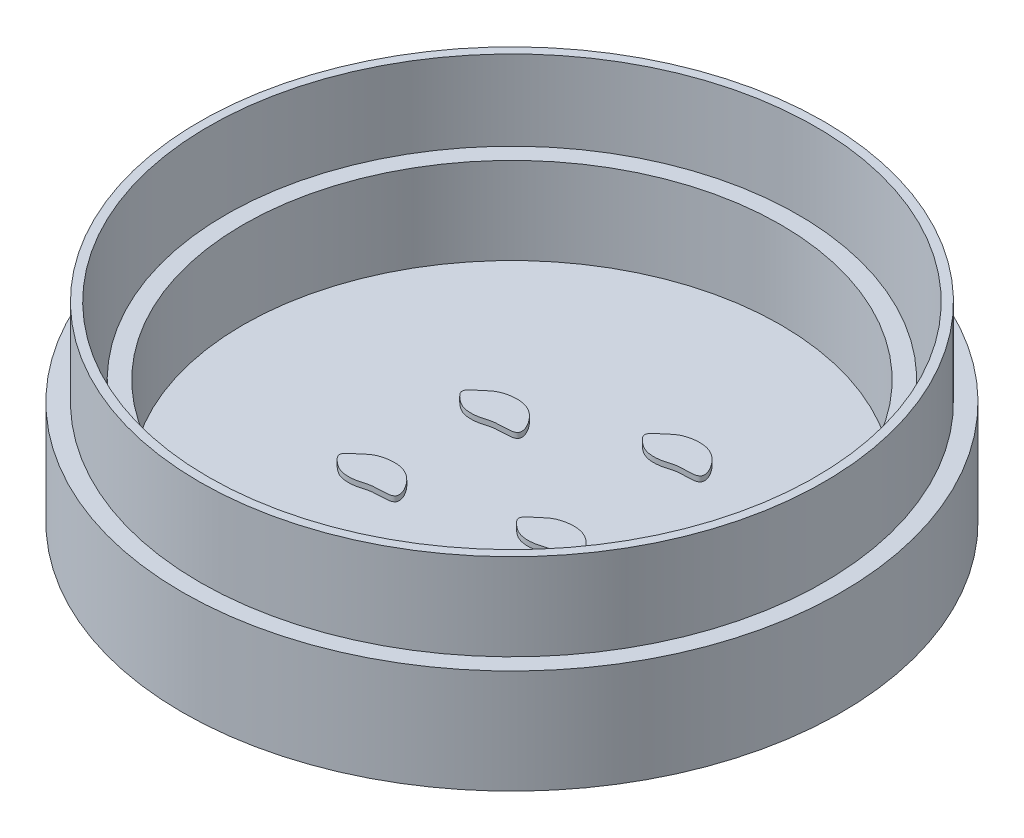
ISO-10303-21;
HEADER;
FILE_DESCRIPTION(('STEP AP214'),'2;1');
FILE_NAME('part.step','',(''),(''),'','','');
FILE_SCHEMA(('AUTOMOTIVE_DESIGN { 1 0 10303 214 1 1 1 1 }'));
ENDSEC;
DATA;
#1=APPLICATION_CONTEXT('core data for automotive mechanical design processes');
#2=APPLICATION_PROTOCOL_DEFINITION('international standard','automotive_design',2000,#1);
#3=PRODUCT_CONTEXT('',#1,'mechanical');
#4=PRODUCT('Part','Part','',(#3));
#5=PRODUCT_RELATED_PRODUCT_CATEGORY('part','',(#4));
#6=PRODUCT_DEFINITION_FORMATION('','',#4);
#7=PRODUCT_DEFINITION_CONTEXT('part definition',#1,'design');
#8=PRODUCT_DEFINITION('design','',#6,#7);
#9=PRODUCT_DEFINITION_SHAPE('','',#8);
#10=(LENGTH_UNIT() NAMED_UNIT(*) SI_UNIT(.MILLI.,.METRE.));
#11=(NAMED_UNIT(*) PLANE_ANGLE_UNIT() SI_UNIT($,.RADIAN.));
#12=(NAMED_UNIT(*) SI_UNIT($,.STERADIAN.) SOLID_ANGLE_UNIT());
#13=UNCERTAINTY_MEASURE_WITH_UNIT(LENGTH_MEASURE(1.E-05),#10,'distance_accuracy_value','');
#14=(GEOMETRIC_REPRESENTATION_CONTEXT(3) GLOBAL_UNCERTAINTY_ASSIGNED_CONTEXT((#13)) GLOBAL_UNIT_ASSIGNED_CONTEXT((#10,
#11,#12)) REPRESENTATION_CONTEXT('',''));
#15=CARTESIAN_POINT('',(0.,0.,0.));
#16=DIRECTION('',(0.,0.,1.));
#17=DIRECTION('',(1.,0.,0.));
#18=AXIS2_PLACEMENT_3D('',#15,#16,#17);
#19=CARTESIAN_POINT('',(0.,2.,0.));
#20=DIRECTION('',(0.,-1.,0.));
#21=DIRECTION('',(0.,0.,-1.));
#22=AXIS2_PLACEMENT_3D('',#19,#20,#21);
#23=CYLINDRICAL_SURFACE('',#22,17.25);
#24=CARTESIAN_POINT('',(0.,2.,0.));
#25=DIRECTION('',(0.,1.,0.));
#26=DIRECTION('',(0.,0.,1.));
#27=AXIS2_PLACEMENT_3D('',#24,#25,#26);
#28=CIRCLE('',#27,17.25);
#29=CARTESIAN_POINT('',(0.,2.,17.25));
#30=VERTEX_POINT('',#29);
#31=EDGE_CURVE('E11',#30,#30,#28,.T.);
#32=ORIENTED_EDGE('',*,*,#31,.F.);
#33=EDGE_LOOP('',(#32));
#34=FACE_BOUND('',#33,.T.);
#35=CARTESIAN_POINT('',(0.,1.,0.));
#36=DIRECTION('',(0.,1.,0.));
#37=DIRECTION('',(0.,0.,1.));
#38=AXIS2_PLACEMENT_3D('',#35,#36,#37);
#39=CIRCLE('',#38,17.25);
#40=CARTESIAN_POINT('',(0.,1.,17.25));
#41=VERTEX_POINT('',#40);
#42=EDGE_CURVE('E47',#41,#41,#39,.T.);
#43=ORIENTED_EDGE('',*,*,#42,.T.);
#44=EDGE_LOOP('',(#43));
#45=FACE_BOUND('',#44,.T.);
#46=ADVANCED_FACE('F44',(#34,#45),#23,.T.);
#47=CARTESIAN_POINT('',(0.,2.,0.));
#48=DIRECTION('',(0.,1.,0.));
#49=DIRECTION('',(0.,0.,1.));
#50=AXIS2_PLACEMENT_3D('',#47,#48,#49);
#51=PLANE('',#50);
#52=ORIENTED_EDGE('',*,*,#31,.T.);
#53=EDGE_LOOP('',(#52));
#54=FACE_BOUND('',#53,.T.);
#55=ADVANCED_FACE('F59',(#54),#51,.T.);
#56=CARTESIAN_POINT('',(0.,1.,0.));
#57=DIRECTION('',(0.,1.,0.));
#58=DIRECTION('',(0.,0.,1.));
#59=AXIS2_PLACEMENT_3D('',#56,#57,#58);
#60=PLANE('',#59);
#61=ORIENTED_EDGE('',*,*,#42,.F.);
#62=EDGE_LOOP('',(#61));
#63=FACE_BOUND('',#62,.T.);
#64=ADVANCED_FACE('F57',(#63),#60,.F.);
#65=CLOSED_SHELL('',(#46,#55,#64));
#66=MANIFOLD_SOLID_BREP('B2',#65);
#67=CARTESIAN_POINT('',(2.91907298444514,2.4,1.42481308734019));
#68=CARTESIAN_POINT('',(3.05107385565414,2.4,1.31530411628247));
#69=CARTESIAN_POINT('',(3.38612260463076,2.4,0.969776654974633));
#70=CARTESIAN_POINT('',(4.40228428248705,2.4,0.710895117513679));
#71=CARTESIAN_POINT('',(5.56454576654291,2.4,1.00555844181758));
#72=CARTESIAN_POINT('',(6.58404244701031,2.4,2.76555268111254));
#73=CARTESIAN_POINT('',(4.97663770993424,2.4,2.51897977990878));
#74=CARTESIAN_POINT('',(4.13000015564603,2.4,2.87540348851139));
#75=CARTESIAN_POINT('',(3.2735109708388,2.4,2.86629151654902));
#76=CARTESIAN_POINT('',(2.72833051055052,2.4,2.47299361130163));
#77=CARTESIAN_POINT('',(2.18513900957989,2.4,1.93630817503822));
#78=CARTESIAN_POINT('',(2.69398618919842,2.4,1.61154688023405));
#79=CARTESIAN_POINT('',(2.91907298444514,2.4,1.42481308734019));
#80=B_SPLINE_CURVE_WITH_KNOTS('',3,(#67,#68,#69,#70,#71,#72,#73,#74,#75,#76,#77,#78,#79),
.UNSPECIFIED.,.T.,.F.,(4,1,1,1,1,1,1,1,1,1,4),(0.,0.0519349611038888,0.17065390645348,
0.317123498335055,0.463290568411312,0.601985486392576,0.676443389966565,0.79247165208382,
0.855761907319149,0.911440933313012,1.),.UNSPECIFIED.);
#81=DIRECTION('',(0.,-1.,0.));
#82=VECTOR('',#81,1.);
#83=SURFACE_OF_LINEAR_EXTRUSION('',#80,#82);
#84=CARTESIAN_POINT('',(2.91907298444514,2.4,1.42481308734019));
#85=VERTEX_POINT('',#84);
#86=EDGE_CURVE('E43',#85,#85,#80,.T.);
#87=ORIENTED_EDGE('',*,*,#86,.T.);
#88=EDGE_LOOP('',(#87));
#89=FACE_BOUND('',#88,.T.);
#90=CARTESIAN_POINT('',(2.91907298444514,2.1,1.42481308734019));
#91=CARTESIAN_POINT('',(3.05107385565414,2.1,1.31530411628247));
#92=CARTESIAN_POINT('',(3.38612260463076,2.1,0.969776654974633));
#93=CARTESIAN_POINT('',(4.40228428248705,2.1,0.710895117513679));
#94=CARTESIAN_POINT('',(5.56454576654291,2.1,1.00555844181758));
#95=CARTESIAN_POINT('',(6.58404244701031,2.1,2.76555268111254));
#96=CARTESIAN_POINT('',(4.97663770993424,2.1,2.51897977990878));
#97=CARTESIAN_POINT('',(4.13000015564603,2.1,2.87540348851139));
#98=CARTESIAN_POINT('',(3.2735109708388,2.1,2.86629151654902));
#99=CARTESIAN_POINT('',(2.72833051055052,2.1,2.47299361130163));
#100=CARTESIAN_POINT('',(2.18513900957989,2.1,1.93630817503822));
#101=CARTESIAN_POINT('',(2.69398618919842,2.1,1.61154688023405));
#102=CARTESIAN_POINT('',(2.91907298444514,2.1,1.42481308734019));
#103=B_SPLINE_CURVE_WITH_KNOTS('',3,(#90,#91,#92,#93,#94,#95,#96,#97,#98,#99,#100,#101,#102),
.UNSPECIFIED.,.T.,.F.,(4,1,1,1,1,1,1,1,1,1,4),(0.,0.0519349611038888,0.17065390645348,
0.317123498335055,0.463290568411312,0.601985486392576,0.676443389966565,0.79247165208382,
0.855761907319149,0.911440933313012,1.),.UNSPECIFIED.);
#104=CARTESIAN_POINT('',(2.91907298444514,2.1,1.42481308734019));
#105=VERTEX_POINT('',#104);
#106=EDGE_CURVE('E97',#105,#105,#103,.T.);
#107=ORIENTED_EDGE('',*,*,#106,.F.);
#108=EDGE_LOOP('',(#107));
#109=FACE_BOUND('',#108,.T.);
#110=ADVANCED_FACE('F93',(#89,#109),#83,.T.);
#111=CARTESIAN_POINT('',(0.,2.4,0.));
#112=DIRECTION('',(0.,1.,0.));
#113=DIRECTION('',(0.,0.,1.));
#114=AXIS2_PLACEMENT_3D('',#111,#112,#113);
#115=PLANE('',#114);
#116=ORIENTED_EDGE('',*,*,#86,.F.);
#117=EDGE_LOOP('',(#116));
#118=FACE_BOUND('',#117,.T.);
#119=ADVANCED_FACE('F116',(#118),#115,.T.);
#120=CARTESIAN_POINT('',(0.,2.1,0.));
#121=DIRECTION('',(0.,1.,0.));
#122=DIRECTION('',(0.,0.,1.));
#123=AXIS2_PLACEMENT_3D('',#120,#121,#122);
#124=PLANE('',#123);
#125=ORIENTED_EDGE('',*,*,#106,.T.);
#126=EDGE_LOOP('',(#125));
#127=FACE_BOUND('',#126,.T.);
#128=ADVANCED_FACE('F113',(#127),#124,.F.);
#129=CLOSED_SHELL('',(#110,#119,#128));
#130=MANIFOLD_SOLID_BREP('B6',#129);
#131=CARTESIAN_POINT('',(2.37549842242235,2.4,-6.37452135199655));
#132=CARTESIAN_POINT('',(2.50749929363135,2.4,-6.48403032305427));
#133=CARTESIAN_POINT('',(2.84254804260796,2.4,-6.8295577843621));
#134=CARTESIAN_POINT('',(3.85870972046426,2.4,-7.08843932182306));
#135=CARTESIAN_POINT('',(5.02097120452011,2.4,-6.79377599751916));
#136=CARTESIAN_POINT('',(6.04046788498752,2.4,-5.03378175822419));
#137=CARTESIAN_POINT('',(4.43306314791145,2.4,-5.28035465942795));
#138=CARTESIAN_POINT('',(3.58642559362323,2.4,-4.92393095082535));
#139=CARTESIAN_POINT('',(2.72993640881601,2.4,-4.93304292278771));
#140=CARTESIAN_POINT('',(2.18475594852773,2.4,-5.32634082803511));
#141=CARTESIAN_POINT('',(1.64156444755709,2.4,-5.86302626429851));
#142=CARTESIAN_POINT('',(2.15041162717562,2.4,-6.18778755910268));
#143=CARTESIAN_POINT('',(2.37549842242235,2.4,-6.37452135199655));
#144=B_SPLINE_CURVE_WITH_KNOTS('',3,(#131,#132,#133,#134,#135,#136,#137,#138,#139,#140,#141,
#142,#143),.UNSPECIFIED.,.T.,.F.,(4,1,1,1,1,1,1,1,1,1,4),(0.,0.0519349611038888,
0.17065390645348,0.317123498335055,0.463290568411312,0.601985486392576,0.676443389966566,
0.792471652083821,0.855761907319149,0.911440933313013,1.),.UNSPECIFIED.);
#145=DIRECTION('',(0.,-1.,0.));
#146=VECTOR('',#145,1.);
#147=SURFACE_OF_LINEAR_EXTRUSION('',#144,#146);
#148=CARTESIAN_POINT('',(2.37549842242235,2.4,-6.37452135199655));
#149=VERTEX_POINT('',#148);
#150=EDGE_CURVE('E92',#149,#149,#144,.T.);
#151=ORIENTED_EDGE('',*,*,#150,.T.);
#152=EDGE_LOOP('',(#151));
#153=FACE_BOUND('',#152,.T.);
#154=CARTESIAN_POINT('',(2.37549842242235,2.1,-6.37452135199655));
#155=CARTESIAN_POINT('',(2.50749929363135,2.1,-6.48403032305427));
#156=CARTESIAN_POINT('',(2.84254804260796,2.1,-6.8295577843621));
#157=CARTESIAN_POINT('',(3.85870972046426,2.1,-7.08843932182306));
#158=CARTESIAN_POINT('',(5.02097120452011,2.1,-6.79377599751916));
#159=CARTESIAN_POINT('',(6.04046788498752,2.1,-5.03378175822419));
#160=CARTESIAN_POINT('',(4.43306314791145,2.1,-5.28035465942795));
#161=CARTESIAN_POINT('',(3.58642559362323,2.1,-4.92393095082535));
#162=CARTESIAN_POINT('',(2.72993640881601,2.1,-4.93304292278771));
#163=CARTESIAN_POINT('',(2.18475594852773,2.1,-5.32634082803511));
#164=CARTESIAN_POINT('',(1.64156444755709,2.1,-5.86302626429851));
#165=CARTESIAN_POINT('',(2.15041162717562,2.1,-6.18778755910268));
#166=CARTESIAN_POINT('',(2.37549842242235,2.1,-6.37452135199655));
#167=B_SPLINE_CURVE_WITH_KNOTS('',3,(#154,#155,#156,#157,#158,#159,#160,#161,#162,#163,#164,
#165,#166),.UNSPECIFIED.,.T.,.F.,(4,1,1,1,1,1,1,1,1,1,4),(0.,0.0519349611038888,
0.17065390645348,0.317123498335055,0.463290568411312,0.601985486392576,0.676443389966566,
0.792471652083821,0.855761907319149,0.911440933313013,1.),.UNSPECIFIED.);
#168=CARTESIAN_POINT('',(2.37549842242235,2.1,-6.37452135199655));
#169=VERTEX_POINT('',#168);
#170=EDGE_CURVE('E157',#169,#169,#167,.T.);
#171=ORIENTED_EDGE('',*,*,#170,.F.);
#172=EDGE_LOOP('',(#171));
#173=FACE_BOUND('',#172,.T.);
#174=ADVANCED_FACE('F153',(#153,#173),#147,.T.);
#175=CARTESIAN_POINT('',(0.,2.4,0.));
#176=DIRECTION('',(0.,1.,0.));
#177=DIRECTION('',(0.,0.,1.));
#178=AXIS2_PLACEMENT_3D('',#175,#176,#177);
#179=PLANE('',#178);
#180=ORIENTED_EDGE('',*,*,#150,.F.);
#181=EDGE_LOOP('',(#180));
#182=FACE_BOUND('',#181,.T.);
#183=ADVANCED_FACE('F176',(#182),#179,.T.);
#184=CARTESIAN_POINT('',(0.,2.1,0.));
#185=DIRECTION('',(0.,1.,0.));
#186=DIRECTION('',(0.,0.,1.));
#187=AXIS2_PLACEMENT_3D('',#184,#185,#186);
#188=PLANE('',#187);
#189=ORIENTED_EDGE('',*,*,#170,.T.);
#190=EDGE_LOOP('',(#189));
#191=FACE_BOUND('',#190,.T.);
#192=ADVANCED_FACE('F173',(#191),#188,.F.);
#193=CLOSED_SHELL('',(#174,#183,#192));
#194=MANIFOLD_SOLID_BREP('B38',#193);
#195=CARTESIAN_POINT('',(-5.05950100079909,2.4,-3.28186123164011));
#196=CARTESIAN_POINT('',(-4.9275001295901,2.4,-3.39137020269784));
#197=CARTESIAN_POINT('',(-4.59245138061348,2.4,-3.73689766400567));
#198=CARTESIAN_POINT('',(-3.57628970275718,2.4,-3.99577920146662));
#199=CARTESIAN_POINT('',(-2.41402821870133,2.4,-3.70111587716272));
#200=CARTESIAN_POINT('',(-1.39453153823392,2.4,-1.94112163786776));
#201=CARTESIAN_POINT('',(-3.00193627530999,2.4,-2.18769453907152));
#202=CARTESIAN_POINT('',(-3.84857382959821,2.4,-1.83127083046891));
#203=CARTESIAN_POINT('',(-4.70506301440543,2.4,-1.84038280243128));
#204=CARTESIAN_POINT('',(-5.25024347469371,2.4,-2.23368070767867));
#205=CARTESIAN_POINT('',(-5.79343497566435,2.4,-2.77036614394208));
#206=CARTESIAN_POINT('',(-5.28458779604581,2.4,-3.09512743874625));
#207=CARTESIAN_POINT('',(-5.05950100079909,2.4,-3.28186123164011));
#208=B_SPLINE_CURVE_WITH_KNOTS('',3,(#195,#196,#197,#198,#199,#200,#201,#202,#203,#204,#205,
#206,#207),.UNSPECIFIED.,.T.,.F.,(4,1,1,1,1,1,1,1,1,1,4),(0.,0.0519349611038888,
0.17065390645348,0.317123498335055,0.463290568411312,0.601985486392576,0.676443389966566,
0.792471652083821,0.855761907319149,0.911440933313013,1.),.UNSPECIFIED.);
#209=DIRECTION('',(0.,-1.,0.));
#210=VECTOR('',#209,1.);
#211=SURFACE_OF_LINEAR_EXTRUSION('',#208,#210);
#212=CARTESIAN_POINT('',(-5.05950100079909,2.4,-3.28186123164011));
#213=VERTEX_POINT('',#212);
#214=EDGE_CURVE('E152',#213,#213,#208,.T.);
#215=ORIENTED_EDGE('',*,*,#214,.T.);
#216=EDGE_LOOP('',(#215));
#217=FACE_BOUND('',#216,.T.);
#218=CARTESIAN_POINT('',(-5.05950100079909,2.1,-3.28186123164011));
#219=CARTESIAN_POINT('',(-4.9275001295901,2.1,-3.39137020269784));
#220=CARTESIAN_POINT('',(-4.59245138061348,2.1,-3.73689766400567));
#221=CARTESIAN_POINT('',(-3.57628970275718,2.1,-3.99577920146662));
#222=CARTESIAN_POINT('',(-2.41402821870133,2.1,-3.70111587716272));
#223=CARTESIAN_POINT('',(-1.39453153823392,2.1,-1.94112163786776));
#224=CARTESIAN_POINT('',(-3.00193627530999,2.1,-2.18769453907152));
#225=CARTESIAN_POINT('',(-3.84857382959821,2.1,-1.83127083046891));
#226=CARTESIAN_POINT('',(-4.70506301440543,2.1,-1.84038280243128));
#227=CARTESIAN_POINT('',(-5.25024347469371,2.1,-2.23368070767867));
#228=CARTESIAN_POINT('',(-5.79343497566435,2.1,-2.77036614394208));
#229=CARTESIAN_POINT('',(-5.28458779604581,2.1,-3.09512743874625));
#230=CARTESIAN_POINT('',(-5.05950100079909,2.1,-3.28186123164011));
#231=B_SPLINE_CURVE_WITH_KNOTS('',3,(#218,#219,#220,#221,#222,#223,#224,#225,#226,#227,#228,
#229,#230),.UNSPECIFIED.,.T.,.F.,(4,1,1,1,1,1,1,1,1,1,4),(0.,0.0519349611038888,
0.17065390645348,0.317123498335055,0.463290568411312,0.601985486392576,0.676443389966566,
0.792471652083821,0.855761907319149,0.911440933313013,1.),.UNSPECIFIED.);
#232=CARTESIAN_POINT('',(-5.05950100079909,2.1,-3.28186123164011));
#233=VERTEX_POINT('',#232);
#234=EDGE_CURVE('E217',#233,#233,#231,.T.);
#235=ORIENTED_EDGE('',*,*,#234,.F.);
#236=EDGE_LOOP('',(#235));
#237=FACE_BOUND('',#236,.T.);
#238=ADVANCED_FACE('F213',(#217,#237),#211,.T.);
#239=CARTESIAN_POINT('',(0.,2.4,0.));
#240=DIRECTION('',(0.,1.,0.));
#241=DIRECTION('',(0.,0.,1.));
#242=AXIS2_PLACEMENT_3D('',#239,#240,#241);
#243=PLANE('',#242);
#244=ORIENTED_EDGE('',*,*,#214,.F.);
#245=EDGE_LOOP('',(#244));
#246=FACE_BOUND('',#245,.T.);
#247=ADVANCED_FACE('F236',(#246),#243,.T.);
#248=CARTESIAN_POINT('',(0.,2.1,0.));
#249=DIRECTION('',(0.,1.,0.));
#250=DIRECTION('',(0.,0.,1.));
#251=AXIS2_PLACEMENT_3D('',#248,#249,#250);
#252=PLANE('',#251);
#253=ORIENTED_EDGE('',*,*,#234,.T.);
#254=EDGE_LOOP('',(#253));
#255=FACE_BOUND('',#254,.T.);
#256=ADVANCED_FACE('F233',(#255),#252,.F.);
#257=CLOSED_SHELL('',(#238,#247,#256));
#258=MANIFOLD_SOLID_BREP('B87',#257);
#259=CARTESIAN_POINT('',(-5.42904263896513,2.4,3.42033965696563));
#260=CARTESIAN_POINT('',(-5.29704176775614,2.4,3.3108306859079));
#261=CARTESIAN_POINT('',(-4.96199301877952,2.4,2.96530322460007));
#262=CARTESIAN_POINT('',(-3.94583134092323,2.4,2.70642168713912));
#263=CARTESIAN_POINT('',(-2.78356985686737,2.4,3.00108501144302));
#264=CARTESIAN_POINT('',(-1.76407317639996,2.4,4.76107925073798));
#265=CARTESIAN_POINT('',(-3.37147791347604,2.4,4.51450634953422));
#266=CARTESIAN_POINT('',(-4.21811546776425,2.4,4.87093005813682));
#267=CARTESIAN_POINT('',(-5.07460465257147,2.4,4.86181808617446));
#268=CARTESIAN_POINT('',(-5.61978511285976,2.4,4.46852018092707));
#269=CARTESIAN_POINT('',(-6.16297661383039,2.4,3.93183474466366));
#270=CARTESIAN_POINT('',(-5.65412943421186,2.4,3.60707344985949));
#271=CARTESIAN_POINT('',(-5.42904263896513,2.4,3.42033965696563));
#272=B_SPLINE_CURVE_WITH_KNOTS('',3,(#259,#260,#261,#262,#263,#264,#265,#266,#267,#268,#269,
#270,#271),.UNSPECIFIED.,.T.,.F.,(4,1,1,1,1,1,1,1,1,1,4),(0.,0.0519349611038888,
0.17065390645348,0.317123498335055,0.463290568411312,0.601985486392576,0.676443389966565,
0.79247165208382,0.855761907319149,0.911440933313012,1.),.UNSPECIFIED.);
#273=DIRECTION('',(0.,-1.,0.));
#274=VECTOR('',#273,1.);
#275=SURFACE_OF_LINEAR_EXTRUSION('',#272,#274);
#276=CARTESIAN_POINT('',(-5.42904263896513,2.4,3.42033965696563));
#277=VERTEX_POINT('',#276);
#278=EDGE_CURVE('E212',#277,#277,#272,.T.);
#279=ORIENTED_EDGE('',*,*,#278,.T.);
#280=EDGE_LOOP('',(#279));
#281=FACE_BOUND('',#280,.T.);
#282=CARTESIAN_POINT('',(-5.42904263896513,2.1,3.42033965696563));
#283=CARTESIAN_POINT('',(-5.29704176775614,2.1,3.3108306859079));
#284=CARTESIAN_POINT('',(-4.96199301877952,2.1,2.96530322460007));
#285=CARTESIAN_POINT('',(-3.94583134092323,2.1,2.70642168713912));
#286=CARTESIAN_POINT('',(-2.78356985686737,2.1,3.00108501144302));
#287=CARTESIAN_POINT('',(-1.76407317639996,2.1,4.76107925073798));
#288=CARTESIAN_POINT('',(-3.37147791347604,2.1,4.51450634953422));
#289=CARTESIAN_POINT('',(-4.21811546776425,2.1,4.87093005813682));
#290=CARTESIAN_POINT('',(-5.07460465257147,2.1,4.86181808617446));
#291=CARTESIAN_POINT('',(-5.61978511285976,2.1,4.46852018092707));
#292=CARTESIAN_POINT('',(-6.16297661383039,2.1,3.93183474466366));
#293=CARTESIAN_POINT('',(-5.65412943421186,2.1,3.60707344985949));
#294=CARTESIAN_POINT('',(-5.42904263896513,2.1,3.42033965696563));
#295=B_SPLINE_CURVE_WITH_KNOTS('',3,(#282,#283,#284,#285,#286,#287,#288,#289,#290,#291,#292,
#293,#294),.UNSPECIFIED.,.T.,.F.,(4,1,1,1,1,1,1,1,1,1,4),(0.,0.0519349611038888,
0.17065390645348,0.317123498335055,0.463290568411312,0.601985486392576,0.676443389966565,
0.79247165208382,0.855761907319149,0.911440933313012,1.),.UNSPECIFIED.);
#296=CARTESIAN_POINT('',(-5.42904263896513,2.1,3.42033965696563));
#297=VERTEX_POINT('',#296);
#298=EDGE_CURVE('E280',#297,#297,#295,.T.);
#299=ORIENTED_EDGE('',*,*,#298,.F.);
#300=EDGE_LOOP('',(#299));
#301=FACE_BOUND('',#300,.T.);
#302=ADVANCED_FACE('F276',(#281,#301),#275,.T.);
#303=CARTESIAN_POINT('',(0.,2.4,0.));
#304=DIRECTION('',(0.,1.,0.));
#305=DIRECTION('',(0.,0.,1.));
#306=AXIS2_PLACEMENT_3D('',#303,#304,#305);
#307=PLANE('',#306);
#308=ORIENTED_EDGE('',*,*,#278,.F.);
#309=EDGE_LOOP('',(#308));
#310=FACE_BOUND('',#309,.T.);
#311=ADVANCED_FACE('F299',(#310),#307,.T.);
#312=CARTESIAN_POINT('',(0.,2.1,0.));
#313=DIRECTION('',(0.,1.,0.));
#314=DIRECTION('',(0.,0.,1.));
#315=AXIS2_PLACEMENT_3D('',#312,#313,#314);
#316=PLANE('',#315);
#317=ORIENTED_EDGE('',*,*,#298,.T.);
#318=EDGE_LOOP('',(#317));
#319=FACE_BOUND('',#318,.T.);
#320=ADVANCED_FACE('F296',(#319),#316,.F.);
#321=CLOSED_SHELL('',(#302,#311,#320));
#322=MANIFOLD_SOLID_BREP('B147',#321);
#323=CARTESIAN_POINT('',(0.,7.1,0.));
#324=DIRECTION('',(0.,1.,0.));
#325=DIRECTION('',(0.,0.,1.));
#326=AXIS2_PLACEMENT_3D('',#323,#324,#325);
#327=PLANE('',#326);
#328=CARTESIAN_POINT('',(0.,7.1,0.));
#329=DIRECTION('',(0.,1.,0.));
#330=DIRECTION('',(0.,0.,1.));
#331=AXIS2_PLACEMENT_3D('',#328,#329,#330);
#332=CIRCLE('',#331,16.5);
#333=CARTESIAN_POINT('',(0.,7.1,16.5));
#334=VERTEX_POINT('',#333);
#335=EDGE_CURVE('E275',#334,#334,#332,.T.);
#336=ORIENTED_EDGE('',*,*,#335,.T.);
#337=EDGE_LOOP('',(#336));
#338=FACE_BOUND('',#337,.T.);
#339=CARTESIAN_POINT('',(0.,7.1,0.));
#340=DIRECTION('',(0.,1.,0.));
#341=DIRECTION('',(0.,0.,1.));
#342=AXIS2_PLACEMENT_3D('',#339,#340,#341);
#343=CIRCLE('',#342,15.5);
#344=CARTESIAN_POINT('',(0.,7.1,15.5));
#345=VERTEX_POINT('',#344);
#346=EDGE_CURVE('E347',#345,#345,#343,.T.);
#347=ORIENTED_EDGE('',*,*,#346,.F.);
#348=EDGE_LOOP('',(#347));
#349=FACE_BOUND('',#348,.T.);
#350=ADVANCED_FACE('F336',(#338,#349),#327,.T.);
#351=CARTESIAN_POINT('',(0.,2.1,0.));
#352=DIRECTION('',(0.,1.,0.));
#353=DIRECTION('',(0.,0.,1.));
#354=AXIS2_PLACEMENT_3D('',#351,#352,#353);
#355=PLANE('',#354);
#356=CARTESIAN_POINT('',(0.,2.1,0.));
#357=DIRECTION('',(0.,1.,0.));
#358=DIRECTION('',(0.,0.,1.));
#359=AXIS2_PLACEMENT_3D('',#356,#357,#358);
#360=CIRCLE('',#359,16.5);
#361=CARTESIAN_POINT('',(0.,2.1,16.5));
#362=VERTEX_POINT('',#361);
#363=EDGE_CURVE('E340',#362,#362,#360,.T.);
#364=ORIENTED_EDGE('',*,*,#363,.F.);
#365=EDGE_LOOP('',(#364));
#366=FACE_BOUND('',#365,.T.);
#367=CARTESIAN_POINT('',(0.,2.1,0.));
#368=DIRECTION('',(0.,1.,0.));
#369=DIRECTION('',(0.,0.,1.));
#370=AXIS2_PLACEMENT_3D('',#367,#368,#369);
#371=CIRCLE('',#370,15.5);
#372=CARTESIAN_POINT('',(0.,2.1,15.5));
#373=VERTEX_POINT('',#372);
#374=EDGE_CURVE('E349',#373,#373,#371,.T.);
#375=ORIENTED_EDGE('',*,*,#374,.T.);
#376=EDGE_LOOP('',(#375));
#377=FACE_BOUND('',#376,.T.);
#378=ADVANCED_FACE('F359',(#366,#377),#355,.F.);
#379=CARTESIAN_POINT('',(0.,7.1,0.));
#380=DIRECTION('',(0.,-1.,0.));
#381=DIRECTION('',(0.,0.,-1.));
#382=AXIS2_PLACEMENT_3D('',#379,#380,#381);
#383=CYLINDRICAL_SURFACE('',#382,16.5);
#384=ORIENTED_EDGE('',*,*,#335,.F.);
#385=EDGE_LOOP('',(#384));
#386=FACE_BOUND('',#385,.T.);
#387=ORIENTED_EDGE('',*,*,#363,.T.);
#388=EDGE_LOOP('',(#387));
#389=FACE_BOUND('',#388,.T.);
#390=ADVANCED_FACE('F338',(#386,#389),#383,.T.);
#391=CARTESIAN_POINT('',(0.,7.1,0.));
#392=DIRECTION('',(0.,-1.,0.));
#393=DIRECTION('',(0.,0.,-1.));
#394=AXIS2_PLACEMENT_3D('',#391,#392,#393);
#395=CYLINDRICAL_SURFACE('',#394,15.5);
#396=ORIENTED_EDGE('',*,*,#346,.T.);
#397=EDGE_LOOP('',(#396));
#398=FACE_BOUND('',#397,.T.);
#399=ORIENTED_EDGE('',*,*,#374,.F.);
#400=EDGE_LOOP('',(#399));
#401=FACE_BOUND('',#400,.T.);
#402=ADVANCED_FACE('F355',(#398,#401),#395,.F.);
#403=CLOSED_SHELL('',(#350,#378,#390,#402));
#404=MANIFOLD_SOLID_BREP('B207',#403);
#405=CARTESIAN_POINT('',(0.,2.1,0.));
#406=DIRECTION('',(0.,-1.,0.));
#407=DIRECTION('',(0.,0.,-1.));
#408=AXIS2_PLACEMENT_3D('',#405,#406,#407);
#409=CYLINDRICAL_SURFACE('',#408,16.5);
#410=CARTESIAN_POINT('',(0.,2.1,0.));
#411=DIRECTION('',(0.,1.,0.));
#412=DIRECTION('',(0.,0.,1.));
#413=AXIS2_PLACEMENT_3D('',#410,#411,#412);
#414=CIRCLE('',#413,16.5);
#415=CARTESIAN_POINT('',(0.,2.1,16.5));
#416=VERTEX_POINT('',#415);
#417=EDGE_CURVE('E335',#416,#416,#414,.T.);
#418=ORIENTED_EDGE('',*,*,#417,.F.);
#419=EDGE_LOOP('',(#418));
#420=FACE_BOUND('',#419,.T.);
#421=CARTESIAN_POINT('',(0.,2.,0.));
#422=DIRECTION('',(0.,1.,0.));
#423=DIRECTION('',(0.,0.,1.));
#424=AXIS2_PLACEMENT_3D('',#421,#422,#423);
#425=CIRCLE('',#424,16.5);
#426=CARTESIAN_POINT('',(0.,2.,16.5));
#427=VERTEX_POINT('',#426);
#428=EDGE_CURVE('E407',#427,#427,#425,.T.);
#429=ORIENTED_EDGE('',*,*,#428,.T.);
#430=EDGE_LOOP('',(#429));
#431=FACE_BOUND('',#430,.T.);
#432=ADVANCED_FACE('F404',(#420,#431),#409,.T.);
#433=CARTESIAN_POINT('',(0.,2.1,0.));
#434=DIRECTION('',(0.,1.,0.));
#435=DIRECTION('',(0.,0.,1.));
#436=AXIS2_PLACEMENT_3D('',#433,#434,#435);
#437=PLANE('',#436);
#438=ORIENTED_EDGE('',*,*,#417,.T.);
#439=EDGE_LOOP('',(#438));
#440=FACE_BOUND('',#439,.T.);
#441=ADVANCED_FACE('F419',(#440),#437,.T.);
#442=CARTESIAN_POINT('',(0.,2.,0.));
#443=DIRECTION('',(0.,1.,0.));
#444=DIRECTION('',(0.,0.,1.));
#445=AXIS2_PLACEMENT_3D('',#442,#443,#444);
#446=PLANE('',#445);
#447=ORIENTED_EDGE('',*,*,#428,.F.);
#448=EDGE_LOOP('',(#447));
#449=FACE_BOUND('',#448,.T.);
#450=ADVANCED_FACE('F417',(#449),#446,.F.);
#451=CLOSED_SHELL('',(#432,#441,#450));
#452=MANIFOLD_SOLID_BREP('B270',#451);
#453=CARTESIAN_POINT('',(0.,6.,0.));
#454=DIRECTION('',(0.,1.,0.));
#455=DIRECTION('',(0.,0.,1.));
#456=AXIS2_PLACEMENT_3D('',#453,#454,#455);
#457=PLANE('',#456);
#458=CARTESIAN_POINT('',(0.,6.,0.));
#459=DIRECTION('',(0.,1.,0.));
#460=DIRECTION('',(0.,0.,1.));
#461=AXIS2_PLACEMENT_3D('',#458,#459,#460);
#462=CIRCLE('',#461,19.);
#463=CARTESIAN_POINT('',(0.,6.,19.));
#464=VERTEX_POINT('',#463);
#465=EDGE_CURVE('E455',#464,#464,#462,.T.);
#466=ORIENTED_EDGE('',*,*,#465,.T.);
#467=EDGE_LOOP('',(#466));
#468=FACE_BOUND('',#467,.T.);
#469=CARTESIAN_POINT('',(0.,6.,0.));
#470=DIRECTION('',(0.,1.,0.));
#471=DIRECTION('',(0.,0.,1.));
#472=AXIS2_PLACEMENT_3D('',#469,#470,#471);
#473=CIRCLE('',#472,18.);
#474=CARTESIAN_POINT('',(0.,6.,18.));
#475=VERTEX_POINT('',#474);
#476=EDGE_CURVE('E462',#475,#475,#473,.T.);
#477=ORIENTED_EDGE('',*,*,#476,.F.);
#478=EDGE_LOOP('',(#477));
#479=FACE_BOUND('',#478,.T.);
#480=ADVANCED_FACE('F444',(#468,#479),#457,.T.);
#481=CARTESIAN_POINT('',(0.,1.,0.));
#482=DIRECTION('',(0.,-1.,0.));
#483=DIRECTION('',(0.,0.,-1.));
#484=AXIS2_PLACEMENT_3D('',#481,#482,#483);
#485=CYLINDRICAL_SURFACE('',#484,19.);
#486=CARTESIAN_POINT('',(0.,0.,0.));
#487=DIRECTION('',(0.,1.,0.));
#488=DIRECTION('',(0.,0.,1.));
#489=AXIS2_PLACEMENT_3D('',#486,#487,#488);
#490=CIRCLE('',#489,19.);
#491=CARTESIAN_POINT('',(0.,0.,19.));
#492=VERTEX_POINT('',#491);
#493=EDGE_CURVE('E451',#492,#492,#490,.T.);
#494=ORIENTED_EDGE('',*,*,#493,.T.);
#495=EDGE_LOOP('',(#494));
#496=FACE_BOUND('',#495,.T.);
#497=ORIENTED_EDGE('',*,*,#465,.F.);
#498=EDGE_LOOP('',(#497));
#499=FACE_BOUND('',#498,.T.);
#500=ADVANCED_FACE('F446',(#496,#499),#485,.T.);
#501=CARTESIAN_POINT('',(0.,0.,0.));
#502=DIRECTION('',(0.,1.,0.));
#503=DIRECTION('',(0.,0.,1.));
#504=AXIS2_PLACEMENT_3D('',#501,#502,#503);
#505=PLANE('',#504);
#506=ORIENTED_EDGE('',*,*,#493,.F.);
#507=EDGE_LOOP('',(#506));
#508=FACE_BOUND('',#507,.T.);
#509=ADVANCED_FACE('F476',(#508),#505,.F.);
#510=CARTESIAN_POINT('',(0.,11.,0.));
#511=DIRECTION('',(0.,1.,0.));
#512=DIRECTION('',(0.,0.,1.));
#513=AXIS2_PLACEMENT_3D('',#510,#511,#512);
#514=PLANE('',#513);
#515=CARTESIAN_POINT('',(0.,11.,0.));
#516=DIRECTION('',(0.,1.,0.));
#517=DIRECTION('',(0.,0.,1.));
#518=AXIS2_PLACEMENT_3D('',#515,#516,#517);
#519=CIRCLE('',#518,18.);
#520=CARTESIAN_POINT('',(0.,11.,18.));
#521=VERTEX_POINT('',#520);
#522=EDGE_CURVE('E459',#521,#521,#519,.T.);
#523=ORIENTED_EDGE('',*,*,#522,.T.);
#524=EDGE_LOOP('',(#523));
#525=FACE_BOUND('',#524,.T.);
#526=CARTESIAN_POINT('',(0.,11.,0.));
#527=DIRECTION('',(0.,1.,0.));
#528=DIRECTION('',(0.,0.,1.));
#529=AXIS2_PLACEMENT_3D('',#526,#527,#528);
#530=CIRCLE('',#529,17.5);
#531=CARTESIAN_POINT('',(0.,11.,17.5));
#532=VERTEX_POINT('',#531);
#533=EDGE_CURVE('E465',#532,#532,#530,.T.);
#534=ORIENTED_EDGE('',*,*,#533,.F.);
#535=EDGE_LOOP('',(#534));
#536=FACE_BOUND('',#535,.T.);
#537=ADVANCED_FACE('F473',(#525,#536),#514,.T.);
#538=CARTESIAN_POINT('',(0.,11.,0.));
#539=DIRECTION('',(0.,-1.,0.));
#540=DIRECTION('',(0.,0.,-1.));
#541=AXIS2_PLACEMENT_3D('',#538,#539,#540);
#542=CYLINDRICAL_SURFACE('',#541,18.);
#543=ORIENTED_EDGE('',*,*,#522,.F.);
#544=EDGE_LOOP('',(#543));
#545=FACE_BOUND('',#544,.T.);
#546=ORIENTED_EDGE('',*,*,#476,.T.);
#547=EDGE_LOOP('',(#546));
#548=FACE_BOUND('',#547,.T.);
#549=ADVANCED_FACE('F475',(#545,#548),#542,.T.);
#550=CARTESIAN_POINT('',(0.,1.,0.));
#551=DIRECTION('',(0.,1.,0.));
#552=DIRECTION('',(0.,0.,1.));
#553=AXIS2_PLACEMENT_3D('',#550,#551,#552);
#554=PLANE('',#553);
#555=CARTESIAN_POINT('',(0.,1.,0.));
#556=DIRECTION('',(0.,1.,0.));
#557=DIRECTION('',(0.,0.,1.));
#558=AXIS2_PLACEMENT_3D('',#555,#556,#557);
#559=CIRCLE('',#558,17.5);
#560=CARTESIAN_POINT('',(0.,1.,17.5));
#561=VERTEX_POINT('',#560);
#562=EDGE_CURVE('E403',#561,#561,#559,.F.);
#563=ORIENTED_EDGE('',*,*,#562,.F.);
#564=EDGE_LOOP('',(#563));
#565=FACE_BOUND('',#564,.T.);
#566=ADVANCED_FACE('F483',(#565),#554,.T.);
#567=CARTESIAN_POINT('',(0.,6.,0.));
#568=DIRECTION('',(0.,-1.,0.));
#569=DIRECTION('',(0.,0.,-1.));
#570=AXIS2_PLACEMENT_3D('',#567,#568,#569);
#571=CYLINDRICAL_SURFACE('',#570,17.5);
#572=ORIENTED_EDGE('',*,*,#562,.T.);
#573=EDGE_LOOP('',(#572));
#574=FACE_BOUND('',#573,.T.);
#575=ORIENTED_EDGE('',*,*,#533,.T.);
#576=EDGE_LOOP('',(#575));
#577=FACE_BOUND('',#576,.T.);
#578=ADVANCED_FACE('F471',(#574,#577),#571,.F.);
#579=CLOSED_SHELL('',(#480,#500,#509,#537,#549,#566,#578));
#580=MANIFOLD_SOLID_BREP('B330_NOT_SHOWN',#579);
#581=ADVANCED_BREP_SHAPE_REPRESENTATION('',(#18,#66,#130,#194,#258,#322,#404,#452,#580),#14);
#582=SHAPE_DEFINITION_REPRESENTATION(#9,#581);
ENDSEC;
END-ISO-10303-21;
